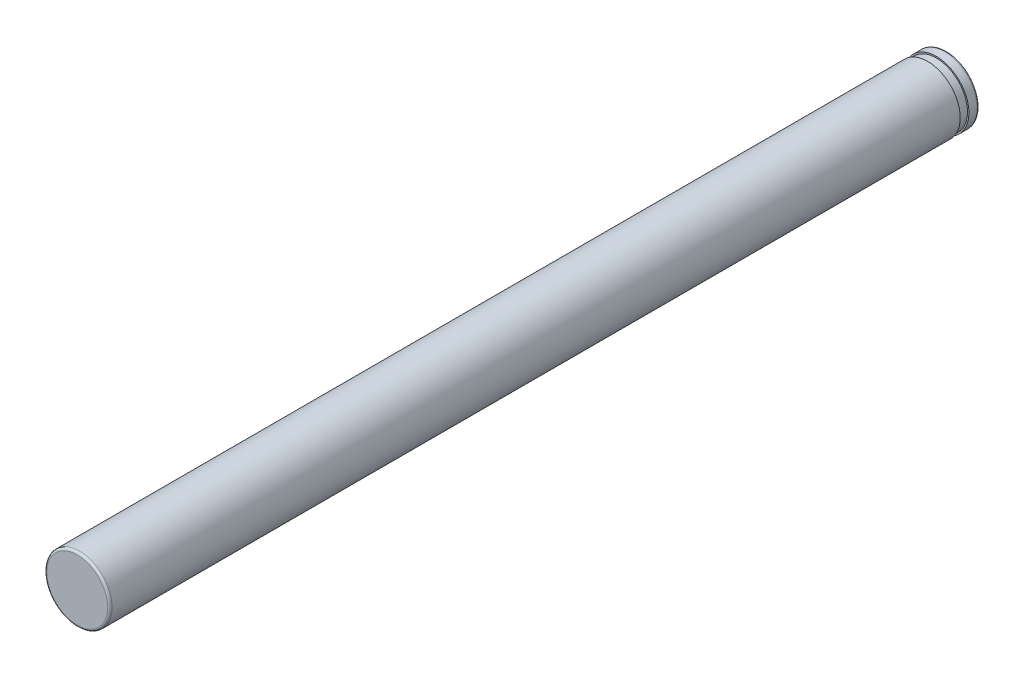
ISO-10303-21;
HEADER;
FILE_DESCRIPTION(('STEP AP214'),'2;1');
FILE_NAME('part.step','',(''),(''),'','','');
FILE_SCHEMA(('AUTOMOTIVE_DESIGN { 1 0 10303 214 1 1 1 1 }'));
ENDSEC;
DATA;
#1=APPLICATION_CONTEXT('core data for automotive mechanical design processes');
#2=APPLICATION_PROTOCOL_DEFINITION('international standard','automotive_design',2000,#1);
#3=PRODUCT_CONTEXT('',#1,'mechanical');
#4=PRODUCT('Part','Part','',(#3));
#5=PRODUCT_RELATED_PRODUCT_CATEGORY('part','',(#4));
#6=PRODUCT_DEFINITION_FORMATION('','',#4);
#7=PRODUCT_DEFINITION_CONTEXT('part definition',#1,'design');
#8=PRODUCT_DEFINITION('design','',#6,#7);
#9=PRODUCT_DEFINITION_SHAPE('','',#8);
#10=(LENGTH_UNIT() NAMED_UNIT(*) SI_UNIT(.MILLI.,.METRE.));
#11=(NAMED_UNIT(*) PLANE_ANGLE_UNIT() SI_UNIT($,.RADIAN.));
#12=(NAMED_UNIT(*) SI_UNIT($,.STERADIAN.) SOLID_ANGLE_UNIT());
#13=UNCERTAINTY_MEASURE_WITH_UNIT(LENGTH_MEASURE(1.E-05),#10,'distance_accuracy_value','');
#14=(GEOMETRIC_REPRESENTATION_CONTEXT(3) GLOBAL_UNCERTAINTY_ASSIGNED_CONTEXT((#13)) GLOBAL_UNIT_ASSIGNED_CONTEXT((#10,
#11,#12)) REPRESENTATION_CONTEXT('',''));
#15=CARTESIAN_POINT('',(0.,0.,0.));
#16=DIRECTION('',(0.,0.,1.));
#17=DIRECTION('',(1.,0.,0.));
#18=AXIS2_PLACEMENT_3D('',#15,#16,#17);
#19=CARTESIAN_POINT('',(0.,0.,40.));
#20=DIRECTION('',(0.,0.,-1.));
#21=DIRECTION('',(-1.,0.,0.));
#22=AXIS2_PLACEMENT_3D('',#19,#20,#21);
#23=CYLINDRICAL_SURFACE('',#22,1.5);
#24=CARTESIAN_POINT('',(0.,0.,0.875553033028685));
#25=DIRECTION('',(0.,0.,1.));
#26=DIRECTION('',(1.,0.,0.));
#27=AXIS2_PLACEMENT_3D('',#24,#25,#26);
#28=CIRCLE('',#27,1.5);
#29=CARTESIAN_POINT('',(1.5,0.,0.875553033028685));
#30=VERTEX_POINT('',#29);
#31=EDGE_CURVE('E37',#30,#30,#28,.T.);
#32=ORIENTED_EDGE('',*,*,#31,.T.);
#33=EDGE_LOOP('',(#32));
#34=FACE_BOUND('',#33,.T.);
#35=CARTESIAN_POINT('',(0.,0.,39.9));
#36=DIRECTION('',(0.,0.,1.));
#37=DIRECTION('',(1.,0.,0.));
#38=AXIS2_PLACEMENT_3D('',#35,#36,#37);
#39=CIRCLE('',#38,1.5);
#40=CARTESIAN_POINT('',(1.5,0.,39.9));
#41=VERTEX_POINT('',#40);
#42=EDGE_CURVE('E46',#41,#41,#39,.F.);
#43=ORIENTED_EDGE('',*,*,#42,.T.);
#44=EDGE_LOOP('',(#43));
#45=FACE_BOUND('',#44,.T.);
#46=ADVANCED_FACE('F33',(#34,#45),#23,.T.);
#47=CARTESIAN_POINT('',(0.,0.,40.));
#48=DIRECTION('',(0.,0.,1.));
#49=DIRECTION('',(1.,0.,0.));
#50=AXIS2_PLACEMENT_3D('',#47,#48,#49);
#51=PLANE('',#50);
#52=CARTESIAN_POINT('',(0.,0.,40.));
#53=DIRECTION('',(0.,0.,1.));
#54=DIRECTION('',(1.,0.,0.));
#55=AXIS2_PLACEMENT_3D('',#52,#53,#54);
#56=CIRCLE('',#55,1.4);
#57=CARTESIAN_POINT('',(1.4,0.,40.));
#58=VERTEX_POINT('',#57);
#59=EDGE_CURVE('E55',#58,#58,#56,.T.);
#60=ORIENTED_EDGE('',*,*,#59,.T.);
#61=EDGE_LOOP('',(#60));
#62=FACE_BOUND('',#61,.T.);
#63=ADVANCED_FACE('F73',(#62),#51,.T.);
#64=CARTESIAN_POINT('',(0.,0.,39.9));
#65=DIRECTION('',(0.,0.,1.));
#66=DIRECTION('',(1.,0.,0.));
#67=AXIS2_PLACEMENT_3D('',#64,#65,#66);
#68=TOROIDAL_SURFACE('',#67,1.4,0.1);
#69=ORIENTED_EDGE('',*,*,#42,.F.);
#70=EDGE_LOOP('',(#69));
#71=FACE_BOUND('',#70,.T.);
#72=ORIENTED_EDGE('',*,*,#59,.F.);
#73=EDGE_LOOP('',(#72));
#74=FACE_BOUND('',#73,.T.);
#75=ADVANCED_FACE('F69',(#71,#74),#68,.T.);
#76=CARTESIAN_POINT('',(-1.58256373591645,0.,0.875553033028688));
#77=DIRECTION('',(0.,0.,1.));
#78=DIRECTION('',(1.,0.,0.));
#79=AXIS2_PLACEMENT_3D('',#76,#77,#78);
#80=PLANE('',#79);
#81=CARTESIAN_POINT('',(0.,0.,0.875553033028688));
#82=DIRECTION('',(0.,0.,-1.));
#83=DIRECTION('',(-1.,0.,0.));
#84=AXIS2_PLACEMENT_3D('',#81,#82,#83);
#85=CIRCLE('',#84,1.43440122980764);
#86=CARTESIAN_POINT('',(-1.43440122980764,0.,0.875553033028688));
#87=VERTEX_POINT('',#86);
#88=EDGE_CURVE('E51',#87,#87,#85,.T.);
#89=ORIENTED_EDGE('',*,*,#88,.F.);
#90=EDGE_LOOP('',(#89));
#91=FACE_BOUND('',#90,.T.);
#92=ORIENTED_EDGE('',*,*,#31,.F.);
#93=EDGE_LOOP('',(#92));
#94=FACE_BOUND('',#93,.T.);
#95=ADVANCED_FACE('F72',(#91,#94),#80,.F.);
#96=CARTESIAN_POINT('',(-1.58256373591645,0.,0.475553033028688));
#97=DIRECTION('',(0.,0.,-1.));
#98=DIRECTION('',(-1.,0.,0.));
#99=AXIS2_PLACEMENT_3D('',#96,#97,#98);
#100=PLANE('',#99);
#101=CARTESIAN_POINT('',(0.,0.,0.475553033028688));
#102=DIRECTION('',(0.,0.,-1.));
#103=DIRECTION('',(-1.,0.,0.));
#104=AXIS2_PLACEMENT_3D('',#101,#102,#103);
#105=CIRCLE('',#104,1.43440122980764);
#106=CARTESIAN_POINT('',(-1.43440122980764,0.,0.475553033028688));
#107=VERTEX_POINT('',#106);
#108=EDGE_CURVE('E57',#107,#107,#105,.T.);
#109=ORIENTED_EDGE('',*,*,#108,.T.);
#110=EDGE_LOOP('',(#109));
#111=FACE_BOUND('',#110,.T.);
#112=CARTESIAN_POINT('',(0.,0.,0.475553033028688));
#113=DIRECTION('',(0.,0.,-1.));
#114=DIRECTION('',(-1.,0.,0.));
#115=AXIS2_PLACEMENT_3D('',#112,#113,#114);
#116=CIRCLE('',#115,1.5);
#117=CARTESIAN_POINT('',(-1.5,0.,0.475553033028688));
#118=VERTEX_POINT('',#117);
#119=EDGE_CURVE('E49',#118,#118,#116,.T.);
#120=ORIENTED_EDGE('',*,*,#119,.F.);
#121=EDGE_LOOP('',(#120));
#122=FACE_BOUND('',#121,.T.);
#123=ADVANCED_FACE('F112',(#111,#122),#100,.F.);
#124=CARTESIAN_POINT('',(0.,0.,0.));
#125=DIRECTION('',(0.,0.,-1.));
#126=DIRECTION('',(-1.,0.,0.));
#127=AXIS2_PLACEMENT_3D('',#124,#125,#126);
#128=CYLINDRICAL_SURFACE('',#127,1.43440122980764);
#129=ORIENTED_EDGE('',*,*,#108,.F.);
#130=EDGE_LOOP('',(#129));
#131=FACE_BOUND('',#130,.T.);
#132=ORIENTED_EDGE('',*,*,#88,.T.);
#133=EDGE_LOOP('',(#132));
#134=FACE_BOUND('',#133,.T.);
#135=ADVANCED_FACE('F89',(#131,#134),#128,.T.);
#136=CARTESIAN_POINT('',(0.,0.,0.));
#137=DIRECTION('',(0.,0.,1.));
#138=DIRECTION('',(1.,0.,0.));
#139=AXIS2_PLACEMENT_3D('',#136,#137,#138);
#140=PLANE('',#139);
#141=CARTESIAN_POINT('',(0.,0.,0.));
#142=DIRECTION('',(0.,0.,1.));
#143=DIRECTION('',(1.,0.,0.));
#144=AXIS2_PLACEMENT_3D('',#141,#142,#143);
#145=CIRCLE('',#144,1.4);
#146=CARTESIAN_POINT('',(1.4,0.,0.));
#147=VERTEX_POINT('',#146);
#148=EDGE_CURVE('E10',#147,#147,#145,.F.);
#149=ORIENTED_EDGE('',*,*,#148,.T.);
#150=EDGE_LOOP('',(#149));
#151=FACE_BOUND('',#150,.T.);
#152=ADVANCED_FACE('F87',(#151),#140,.F.);
#153=CARTESIAN_POINT('',(0.,0.,0.100000000000003));
#154=DIRECTION('',(0.,0.,1.));
#155=DIRECTION('',(1.,0.,0.));
#156=AXIS2_PLACEMENT_3D('',#153,#154,#155);
#157=TOROIDAL_SURFACE('',#156,1.4,0.1);
#158=ORIENTED_EDGE('',*,*,#148,.F.);
#159=EDGE_LOOP('',(#158));
#160=FACE_BOUND('',#159,.T.);
#161=CARTESIAN_POINT('',(0.,0.,0.100000000000003));
#162=DIRECTION('',(0.,0.,1.));
#163=DIRECTION('',(1.,0.,0.));
#164=AXIS2_PLACEMENT_3D('',#161,#162,#163);
#165=CIRCLE('',#164,1.5);
#166=CARTESIAN_POINT('',(1.5,0.,0.100000000000003));
#167=VERTEX_POINT('',#166);
#168=EDGE_CURVE('E41',#167,#167,#165,.T.);
#169=ORIENTED_EDGE('',*,*,#168,.F.);
#170=EDGE_LOOP('',(#169));
#171=FACE_BOUND('',#170,.T.);
#172=ADVANCED_FACE('F35',(#160,#171),#157,.T.);
#173=ORIENTED_EDGE('',*,*,#119,.T.);
#174=EDGE_LOOP('',(#173));
#175=FACE_BOUND('',#174,.T.);
#176=ORIENTED_EDGE('',*,*,#168,.T.);
#177=EDGE_LOOP('',(#176));
#178=FACE_BOUND('',#177,.T.);
#179=ADVANCED_FACE('F83',(#175,#178),#23,.T.);
#180=CLOSED_SHELL('',(#46,#63,#75,#95,#123,#135,#152,#172,#179));
#181=MANIFOLD_SOLID_BREP('B2',#180);
#182=ADVANCED_BREP_SHAPE_REPRESENTATION('',(#18,#181),#14);
#183=SHAPE_DEFINITION_REPRESENTATION(#9,#182);
ENDSEC;
END-ISO-10303-21;
